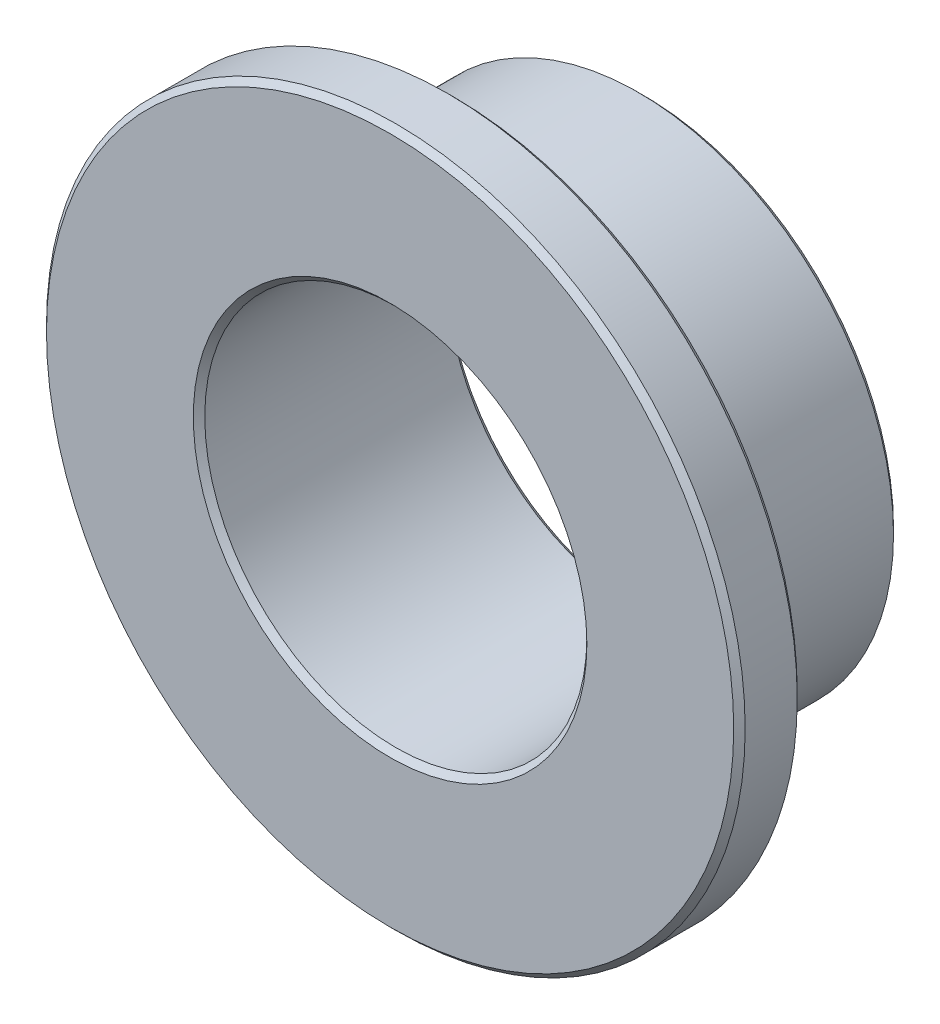
ISO-10303-21;
HEADER;
FILE_DESCRIPTION(('STEP AP214'),'2;1');
FILE_NAME('part.step','',(''),(''),'','','');
FILE_SCHEMA(('AUTOMOTIVE_DESIGN { 1 0 10303 214 1 1 1 1 }'));
ENDSEC;
DATA;
#1=APPLICATION_CONTEXT('core data for automotive mechanical design processes');
#2=APPLICATION_PROTOCOL_DEFINITION('international standard','automotive_design',2000,#1);
#3=PRODUCT_CONTEXT('',#1,'mechanical');
#4=PRODUCT('Part','Part','',(#3));
#5=PRODUCT_RELATED_PRODUCT_CATEGORY('part','',(#4));
#6=PRODUCT_DEFINITION_FORMATION('','',#4);
#7=PRODUCT_DEFINITION_CONTEXT('part definition',#1,'design');
#8=PRODUCT_DEFINITION('design','',#6,#7);
#9=PRODUCT_DEFINITION_SHAPE('','',#8);
#10=(LENGTH_UNIT() NAMED_UNIT(*) SI_UNIT(.MILLI.,.METRE.));
#11=(NAMED_UNIT(*) PLANE_ANGLE_UNIT() SI_UNIT($,.RADIAN.));
#12=(NAMED_UNIT(*) SI_UNIT($,.STERADIAN.) SOLID_ANGLE_UNIT());
#13=UNCERTAINTY_MEASURE_WITH_UNIT(LENGTH_MEASURE(1.E-05),#10,'distance_accuracy_value','');
#14=(GEOMETRIC_REPRESENTATION_CONTEXT(3) GLOBAL_UNCERTAINTY_ASSIGNED_CONTEXT((#13)) GLOBAL_UNIT_ASSIGNED_CONTEXT((#10,
#11,#12)) REPRESENTATION_CONTEXT('',''));
#15=CARTESIAN_POINT('',(0.,0.,0.));
#16=DIRECTION('',(0.,0.,1.));
#17=DIRECTION('',(1.,0.,0.));
#18=AXIS2_PLACEMENT_3D('',#15,#16,#17);
#19=CARTESIAN_POINT('',(0.,0.,1.5875));
#20=DIRECTION('',(0.,0.,1.));
#21=DIRECTION('',(1.,0.,0.));
#22=AXIS2_PLACEMENT_3D('',#19,#20,#21);
#23=CYLINDRICAL_SURFACE('',#22,8.73125);
#24=CARTESIAN_POINT('',(0.,0.,3.031744));
#25=DIRECTION('',(0.,0.,1.));
#26=DIRECTION('',(1.,0.,0.));
#27=AXIS2_PLACEMENT_3D('',#24,#25,#26);
#28=CIRCLE('',#27,8.73125);
#29=CARTESIAN_POINT('',(8.73125,0.,3.031744));
#30=VERTEX_POINT('',#29);
#31=EDGE_CURVE('E71',#30,#30,#28,.F.);
#32=ORIENTED_EDGE('',*,*,#31,.T.);
#33=EDGE_LOOP('',(#32));
#34=FACE_BOUND('',#33,.T.);
#35=CARTESIAN_POINT('',(0.,0.,1.730756));
#36=DIRECTION('',(0.,0.,1.));
#37=DIRECTION('',(1.,0.,0.));
#38=AXIS2_PLACEMENT_3D('',#35,#36,#37);
#39=CIRCLE('',#38,8.73125);
#40=CARTESIAN_POINT('',(8.73125,0.,1.730756));
#41=VERTEX_POINT('',#40);
#42=EDGE_CURVE('E75',#41,#41,#39,.T.);
#43=ORIENTED_EDGE('',*,*,#42,.T.);
#44=EDGE_LOOP('',(#43));
#45=FACE_BOUND('',#44,.T.);
#46=ADVANCED_FACE('F39',(#34,#45),#23,.T.);
#47=CARTESIAN_POINT('',(0.,0.,1.5875));
#48=DIRECTION('',(0.,0.,1.));
#49=DIRECTION('',(1.,0.,0.));
#50=AXIS2_PLACEMENT_3D('',#47,#48,#49);
#51=PLANE('',#50);
#52=CARTESIAN_POINT('',(0.,0.,1.5875));
#53=DIRECTION('',(0.,0.,1.));
#54=DIRECTION('',(1.,0.,0.));
#55=AXIS2_PLACEMENT_3D('',#52,#53,#54);
#56=CIRCLE('',#55,8.587994);
#57=CARTESIAN_POINT('',(8.587994,0.,1.5875));
#58=VERTEX_POINT('',#57);
#59=EDGE_CURVE('E63',#58,#58,#56,.F.);
#60=ORIENTED_EDGE('',*,*,#59,.T.);
#61=EDGE_LOOP('',(#60));
#62=FACE_BOUND('',#61,.T.);
#63=CARTESIAN_POINT('',(0.,0.,1.5875));
#64=DIRECTION('',(0.,0.,1.));
#65=DIRECTION('',(1.,0.,0.));
#66=AXIS2_PLACEMENT_3D('',#63,#64,#65);
#67=CIRCLE('',#66,6.51865599999999);
#68=CARTESIAN_POINT('',(6.51865599999999,0.,1.5875));
#69=VERTEX_POINT('',#68);
#70=EDGE_CURVE('E67',#69,#69,#67,.T.);
#71=ORIENTED_EDGE('',*,*,#70,.T.);
#72=EDGE_LOOP('',(#71));
#73=FACE_BOUND('',#72,.T.);
#74=ADVANCED_FACE('F111',(#62,#73),#51,.F.);
#75=CARTESIAN_POINT('',(0.,0.,3.175));
#76=DIRECTION('',(0.,0.,1.));
#77=DIRECTION('',(1.,0.,0.));
#78=AXIS2_PLACEMENT_3D('',#75,#76,#77);
#79=PLANE('',#78);
#80=CARTESIAN_POINT('',(0.,0.,3.175));
#81=DIRECTION('',(0.,0.,1.));
#82=DIRECTION('',(1.,0.,0.));
#83=AXIS2_PLACEMENT_3D('',#80,#81,#82);
#84=CIRCLE('',#83,4.91845600000001);
#85=CARTESIAN_POINT('',(4.91845600000001,0.,3.175));
#86=VERTEX_POINT('',#85);
#87=EDGE_CURVE('E79',#86,#86,#84,.F.);
#88=ORIENTED_EDGE('',*,*,#87,.T.);
#89=EDGE_LOOP('',(#88));
#90=FACE_BOUND('',#89,.T.);
#91=CARTESIAN_POINT('',(0.,0.,3.175));
#92=DIRECTION('',(0.,0.,1.));
#93=DIRECTION('',(1.,0.,0.));
#94=AXIS2_PLACEMENT_3D('',#91,#92,#93);
#95=CIRCLE('',#94,8.587994);
#96=CARTESIAN_POINT('',(8.587994,0.,3.175));
#97=VERTEX_POINT('',#96);
#98=EDGE_CURVE('E83',#97,#97,#95,.T.);
#99=ORIENTED_EDGE('',*,*,#98,.T.);
#100=EDGE_LOOP('',(#99));
#101=FACE_BOUND('',#100,.T.);
#102=ADVANCED_FACE('F117',(#90,#101),#79,.T.);
#103=CARTESIAN_POINT('',(0.,0.,1.5875));
#104=DIRECTION('',(0.,0.,1.));
#105=DIRECTION('',(1.,0.,0.));
#106=AXIS2_PLACEMENT_3D('',#103,#104,#105);
#107=CYLINDRICAL_SURFACE('',#106,4.7752);
#108=CARTESIAN_POINT('',(0.,0.,3.03174399999999));
#109=DIRECTION('',(0.,0.,1.));
#110=DIRECTION('',(1.,0.,0.));
#111=AXIS2_PLACEMENT_3D('',#108,#109,#110);
#112=CIRCLE('',#111,4.7752);
#113=CARTESIAN_POINT('',(4.7752,0.,3.03174399999999));
#114=VERTEX_POINT('',#113);
#115=EDGE_CURVE('E87',#114,#114,#112,.T.);
#116=ORIENTED_EDGE('',*,*,#115,.T.);
#117=EDGE_LOOP('',(#116));
#118=FACE_BOUND('',#117,.T.);
#119=CARTESIAN_POINT('',(0.,0.,-3.03174399999999));
#120=DIRECTION('',(0.,0.,1.));
#121=DIRECTION('',(1.,0.,0.));
#122=AXIS2_PLACEMENT_3D('',#119,#120,#121);
#123=CIRCLE('',#122,4.7752);
#124=CARTESIAN_POINT('',(4.7752,0.,-3.03174399999999));
#125=VERTEX_POINT('',#124);
#126=EDGE_CURVE('E91',#125,#125,#123,.F.);
#127=ORIENTED_EDGE('',*,*,#126,.T.);
#128=EDGE_LOOP('',(#127));
#129=FACE_BOUND('',#128,.T.);
#130=ADVANCED_FACE('F96',(#118,#129),#107,.F.);
#131=CARTESIAN_POINT('',(0.,0.,-3.175));
#132=DIRECTION('',(0.,0.,1.));
#133=DIRECTION('',(1.,0.,0.));
#134=AXIS2_PLACEMENT_3D('',#131,#132,#133);
#135=CYLINDRICAL_SURFACE('',#134,6.3754);
#136=CARTESIAN_POINT('',(0.,0.,1.44424400000001));
#137=DIRECTION('',(0.,0.,1.));
#138=DIRECTION('',(1.,0.,0.));
#139=AXIS2_PLACEMENT_3D('',#136,#137,#138);
#140=CIRCLE('',#139,6.3754);
#141=CARTESIAN_POINT('',(6.3754,0.,1.44424400000001));
#142=VERTEX_POINT('',#141);
#143=EDGE_CURVE('E52',#142,#142,#140,.F.);
#144=CARTESIAN_POINT('',(0.,0.,-3.03174399999999));
#145=DIRECTION('',(0.,0.,1.));
#146=DIRECTION('',(1.,0.,0.));
#147=AXIS2_PLACEMENT_3D('',#144,#145,#146);
#148=CIRCLE('',#147,6.3754);
#149=CARTESIAN_POINT('',(6.3754,0.,-3.03174399999999));
#150=VERTEX_POINT('',#149);
#151=EDGE_CURVE('E57',#150,#150,#148,.T.);
#152=CARTESIAN_POINT('',(6.3754,0.,1.44424400000001));
#153=CARTESIAN_POINT('',(6.3754,0.,1.39761912500001));
#154=CARTESIAN_POINT('',(6.3754,0.,1.35099425000001));
#155=CARTESIAN_POINT('',(6.3754,0.,1.25774450000001));
#156=CARTESIAN_POINT('',(6.3754,0.,1.21111962500001));
#157=CARTESIAN_POINT('',(6.3754,0.,1.11786987500001));
#158=CARTESIAN_POINT('',(6.3754,0.,1.07124500000001));
#159=CARTESIAN_POINT('',(6.3754,0.,0.977995250000006));
#160=CARTESIAN_POINT('',(6.3754,0.,0.931370375000006));
#161=CARTESIAN_POINT('',(6.3754,0.,0.838120625000006));
#162=CARTESIAN_POINT('',(6.3754,0.,0.791495750000006));
#163=CARTESIAN_POINT('',(6.3754,0.,0.698246000000006));
#164=CARTESIAN_POINT('',(6.3754,0.,0.651621125000006));
#165=CARTESIAN_POINT('',(6.3754,0.,0.558371375000006));
#166=CARTESIAN_POINT('',(6.3754,0.,0.511746500000006));
#167=CARTESIAN_POINT('',(6.3754,0.,0.418496750000006));
#168=CARTESIAN_POINT('',(6.3754,0.,0.371871875000006));
#169=CARTESIAN_POINT('',(6.3754,0.,0.278622125000006));
#170=CARTESIAN_POINT('',(6.3754,0.,0.231997250000007));
#171=CARTESIAN_POINT('',(6.3754,0.,0.138747500000007));
#172=CARTESIAN_POINT('',(6.3754,0.,0.0921226250000068));
#173=CARTESIAN_POINT('',(6.3754,0.,-0.00112712499999321));
#174=CARTESIAN_POINT('',(6.3754,0.,-0.0477519999999932));
#175=CARTESIAN_POINT('',(6.3754,0.,-0.141001749999993));
#176=CARTESIAN_POINT('',(6.3754,0.,-0.187626624999993));
#177=CARTESIAN_POINT('',(6.3754,0.,-0.280876374999993));
#178=CARTESIAN_POINT('',(6.3754,0.,-0.327501249999993));
#179=CARTESIAN_POINT('',(6.3754,0.,-0.420750999999993));
#180=CARTESIAN_POINT('',(6.3754,0.,-0.467375874999993));
#181=CARTESIAN_POINT('',(6.3754,0.,-0.560625624999993));
#182=CARTESIAN_POINT('',(6.3754,0.,-0.607250499999992));
#183=CARTESIAN_POINT('',(6.3754,0.,-0.700500249999992));
#184=CARTESIAN_POINT('',(6.3754,0.,-0.747125124999992));
#185=CARTESIAN_POINT('',(6.3754,0.,-0.840374874999992));
#186=CARTESIAN_POINT('',(6.3754,0.,-0.886999749999992));
#187=CARTESIAN_POINT('',(6.3754,0.,-0.980249499999992));
#188=CARTESIAN_POINT('',(6.3754,0.,-1.02687437499999));
#189=CARTESIAN_POINT('',(6.3754,0.,-1.12012412499999));
#190=CARTESIAN_POINT('',(6.3754,0.,-1.16674899999999));
#191=CARTESIAN_POINT('',(6.3754,0.,-1.25999874999999));
#192=CARTESIAN_POINT('',(6.3754,0.,-1.30662362499999));
#193=CARTESIAN_POINT('',(6.3754,0.,-1.39987337499999));
#194=CARTESIAN_POINT('',(6.3754,0.,-1.44649824999999));
#195=CARTESIAN_POINT('',(6.3754,0.,-1.53974799999999));
#196=CARTESIAN_POINT('',(6.3754,0.,-1.58637287499999));
#197=CARTESIAN_POINT('',(6.3754,0.,-1.67962262499999));
#198=CARTESIAN_POINT('',(6.3754,0.,-1.72624749999999));
#199=CARTESIAN_POINT('',(6.3754,0.,-1.81949724999999));
#200=CARTESIAN_POINT('',(6.3754,0.,-1.86612212499999));
#201=CARTESIAN_POINT('',(6.3754,0.,-1.95937187499999));
#202=CARTESIAN_POINT('',(6.3754,0.,-2.00599674999999));
#203=CARTESIAN_POINT('',(6.3754,0.,-2.09924649999999));
#204=CARTESIAN_POINT('',(6.3754,0.,-2.14587137499999));
#205=CARTESIAN_POINT('',(6.3754,0.,-2.23912112499999));
#206=CARTESIAN_POINT('',(6.3754,0.,-2.28574599999999));
#207=CARTESIAN_POINT('',(6.3754,0.,-2.37899574999999));
#208=CARTESIAN_POINT('',(6.3754,0.,-2.42562062499999));
#209=CARTESIAN_POINT('',(6.3754,0.,-2.51887037499999));
#210=CARTESIAN_POINT('',(6.3754,0.,-2.56549524999999));
#211=CARTESIAN_POINT('',(6.3754,0.,-2.65874499999999));
#212=CARTESIAN_POINT('',(6.3754,0.,-2.70536987499999));
#213=CARTESIAN_POINT('',(6.3754,0.,-2.79861962499999));
#214=CARTESIAN_POINT('',(6.3754,0.,-2.84524449999999));
#215=CARTESIAN_POINT('',(6.3754,0.,-2.93849424999999));
#216=CARTESIAN_POINT('',(6.3754,0.,-2.98511912499999));
#217=CARTESIAN_POINT('',(6.3754,0.,-3.03174399999999));
#218=B_SPLINE_CURVE_WITH_KNOTS('',3,(#152,#153,#154,#155,#156,#157,#158,#159,#160,#161,#162,
#163,#164,#165,#166,#167,#168,#169,#170,#171,#172,#173,#174,#175,#176,#177,#178,#179,#180,#181,
#182,#183,#184,#185,#186,#187,#188,#189,#190,#191,#192,#193,#194,#195,#196,#197,#198,#199,#200,
#201,#202,#203,#204,#205,#206,#207,#208,#209,#210,#211,#212,#213,#214,#215,#216,#217),
.UNSPECIFIED.,.F.,.F.,(4,2,2,2,2,2,2,2,2,2,2,2,2,2,2,2,2,2,2,2,2,2,2,2,2,2,2,2,2,2,2,2,4),(0.,
0.139874625,0.27974925,0.419623875,0.559498499999999,0.699373125,0.839247749999999,
0.979122374999999,1.118997,1.258871625,1.39874625,1.538620875,1.6784955,1.818370125,1.95824475,
2.098119375,2.237994,2.377868625,2.51774325,2.657617875,2.7974925,2.937367125,3.07724175,
3.217116375,3.356991,3.496865625,3.63674025,3.776614875,3.9164895,4.056364125,4.19623874999999,
4.336113375,4.47598799999999),.UNSPECIFIED.);
#219=EDGE_CURVE('BSEAM179',#142,#150,#218,.T.);
#220=ORIENTED_EDGE('',*,*,#143,.T.);
#221=ORIENTED_EDGE('',*,*,#151,.T.);
#222=ORIENTED_EDGE('',*,*,#219,.T.);
#223=ORIENTED_EDGE('',*,*,#219,.F.);
#224=EDGE_LOOP('',(#220,#222,#221,#223));
#225=FACE_BOUND('',#224,.T.);
#226=ADVANCED_FACE('F179',(#225),#135,.T.);
#227=CARTESIAN_POINT('',(0.,0.,-3.175));
#228=DIRECTION('',(0.,0.,1.));
#229=DIRECTION('',(1.,0.,0.));
#230=AXIS2_PLACEMENT_3D('',#227,#228,#229);
#231=PLANE('',#230);
#232=CARTESIAN_POINT('',(0.,0.,-3.175));
#233=DIRECTION('',(0.,0.,1.));
#234=DIRECTION('',(1.,0.,0.));
#235=AXIS2_PLACEMENT_3D('',#232,#233,#234);
#236=CIRCLE('',#235,4.918456);
#237=CARTESIAN_POINT('',(4.918456,0.,-3.175));
#238=VERTEX_POINT('',#237);
#239=EDGE_CURVE('E10',#238,#238,#236,.T.);
#240=ORIENTED_EDGE('',*,*,#239,.T.);
#241=EDGE_LOOP('',(#240));
#242=FACE_BOUND('',#241,.T.);
#243=CARTESIAN_POINT('',(0.,0.,-3.175));
#244=DIRECTION('',(0.,0.,1.));
#245=DIRECTION('',(1.,0.,0.));
#246=AXIS2_PLACEMENT_3D('',#243,#244,#245);
#247=CIRCLE('',#246,6.23214399999999);
#248=CARTESIAN_POINT('',(6.23214399999999,0.,-3.175));
#249=VERTEX_POINT('',#248);
#250=EDGE_CURVE('E47',#249,#249,#247,.F.);
#251=ORIENTED_EDGE('',*,*,#250,.T.);
#252=EDGE_LOOP('',(#251));
#253=FACE_BOUND('',#252,.T.);
#254=ADVANCED_FACE('F127',(#242,#253),#231,.F.);
#255=CARTESIAN_POINT('',(0.,0.,3.03174399999999));
#256=DIRECTION('',(0.,0.,1.));
#257=DIRECTION('',(1.,0.,0.));
#258=AXIS2_PLACEMENT_3D('',#255,#256,#257);
#259=CONICAL_SURFACE('',#258,4.7752,0.785398163397442);
#260=ORIENTED_EDGE('',*,*,#87,.F.);
#261=EDGE_LOOP('',(#260));
#262=FACE_BOUND('',#261,.T.);
#263=ORIENTED_EDGE('',*,*,#115,.F.);
#264=EDGE_LOOP('',(#263));
#265=FACE_BOUND('',#264,.T.);
#266=ADVANCED_FACE('F123',(#262,#265),#259,.F.);
#267=CARTESIAN_POINT('',(0.,0.,3.175));
#268=DIRECTION('',(0.,0.,-1.));
#269=DIRECTION('',(-1.,0.,0.));
#270=AXIS2_PLACEMENT_3D('',#267,#268,#269);
#271=CONICAL_SURFACE('',#270,8.587994,0.785398163397448);
#272=ORIENTED_EDGE('',*,*,#31,.F.);
#273=EDGE_LOOP('',(#272));
#274=FACE_BOUND('',#273,.T.);
#275=ORIENTED_EDGE('',*,*,#98,.F.);
#276=EDGE_LOOP('',(#275));
#277=FACE_BOUND('',#276,.T.);
#278=ADVANCED_FACE('F126',(#274,#277),#271,.T.);
#279=CARTESIAN_POINT('',(0.,0.,1.730756));
#280=DIRECTION('',(0.,0.,1.));
#281=DIRECTION('',(1.,0.,0.));
#282=AXIS2_PLACEMENT_3D('',#279,#280,#281);
#283=CONICAL_SURFACE('',#282,8.73125,0.785398163397448);
#284=CARTESIAN_POINT('',(8.587994,0.,1.5875));
#285=CARTESIAN_POINT('',(8.58948625,0.,1.58899225));
#286=CARTESIAN_POINT('',(8.5909785,0.,1.5904845));
#287=CARTESIAN_POINT('',(8.593963,0.,1.593469));
#288=CARTESIAN_POINT('',(8.59545525,0.,1.59496125));
#289=CARTESIAN_POINT('',(8.59843975,0.,1.59794575));
#290=CARTESIAN_POINT('',(8.599932,0.,1.599438));
#291=CARTESIAN_POINT('',(8.6029165,0.,1.6024225));
#292=CARTESIAN_POINT('',(8.60440875,0.,1.60391475));
#293=CARTESIAN_POINT('',(8.60739325,0.,1.60689925));
#294=CARTESIAN_POINT('',(8.6088855,0.,1.6083915));
#295=CARTESIAN_POINT('',(8.61187,0.,1.611376));
#296=CARTESIAN_POINT('',(8.61336225,0.,1.61286825));
#297=CARTESIAN_POINT('',(8.61634675,0.,1.61585275));
#298=CARTESIAN_POINT('',(8.617839,0.,1.617345));
#299=CARTESIAN_POINT('',(8.6208235,0.,1.6203295));
#300=CARTESIAN_POINT('',(8.62231575,0.,1.62182175));
#301=CARTESIAN_POINT('',(8.62530025,0.,1.62480625));
#302=CARTESIAN_POINT('',(8.6267925,0.,1.6262985));
#303=CARTESIAN_POINT('',(8.629777,0.,1.629283));
#304=CARTESIAN_POINT('',(8.63126925,0.,1.63077525));
#305=CARTESIAN_POINT('',(8.63425375,0.,1.63375975));
#306=CARTESIAN_POINT('',(8.635746,0.,1.635252));
#307=CARTESIAN_POINT('',(8.6387305,0.,1.6382365));
#308=CARTESIAN_POINT('',(8.64022275,0.,1.63972875));
#309=CARTESIAN_POINT('',(8.64320725,0.,1.64271325));
#310=CARTESIAN_POINT('',(8.6446995,0.,1.6442055));
#311=CARTESIAN_POINT('',(8.647684,0.,1.64719));
#312=CARTESIAN_POINT('',(8.64917625,0.,1.64868225));
#313=CARTESIAN_POINT('',(8.65216075,0.,1.65166675));
#314=CARTESIAN_POINT('',(8.653653,0.,1.653159));
#315=CARTESIAN_POINT('',(8.6566375,0.,1.6561435));
#316=CARTESIAN_POINT('',(8.65812975,0.,1.65763575));
#317=CARTESIAN_POINT('',(8.66111425,0.,1.66062025));
#318=CARTESIAN_POINT('',(8.6626065,0.,1.6621125));
#319=CARTESIAN_POINT('',(8.665591,0.,1.665097));
#320=CARTESIAN_POINT('',(8.66708325,0.,1.66658925));
#321=CARTESIAN_POINT('',(8.67006775,0.,1.66957375));
#322=CARTESIAN_POINT('',(8.67156,0.,1.671066));
#323=CARTESIAN_POINT('',(8.6745445,0.,1.6740505));
#324=CARTESIAN_POINT('',(8.67603675,0.,1.67554275));
#325=CARTESIAN_POINT('',(8.67902125,0.,1.67852725));
#326=CARTESIAN_POINT('',(8.6805135,0.,1.6800195));
#327=CARTESIAN_POINT('',(8.683498,0.,1.683004));
#328=CARTESIAN_POINT('',(8.68499025,0.,1.68449625));
#329=CARTESIAN_POINT('',(8.68797475,0.,1.68748075));
#330=CARTESIAN_POINT('',(8.689467,0.,1.688973));
#331=CARTESIAN_POINT('',(8.6924515,0.,1.6919575));
#332=CARTESIAN_POINT('',(8.69394375,0.,1.69344975));
#333=CARTESIAN_POINT('',(8.69692825,0.,1.69643425));
#334=CARTESIAN_POINT('',(8.6984205,0.,1.6979265));
#335=CARTESIAN_POINT('',(8.701405,0.,1.700911));
#336=CARTESIAN_POINT('',(8.70289725,0.,1.70240325));
#337=CARTESIAN_POINT('',(8.70588175,0.,1.70538775));
#338=CARTESIAN_POINT('',(8.707374,0.,1.70688));
#339=CARTESIAN_POINT('',(8.7103585,0.,1.7098645));
#340=CARTESIAN_POINT('',(8.71185075,0.,1.71135675));
#341=CARTESIAN_POINT('',(8.71483525,0.,1.71434125));
#342=CARTESIAN_POINT('',(8.7163275,0.,1.7158335));
#343=CARTESIAN_POINT('',(8.719312,0.,1.718818));
#344=CARTESIAN_POINT('',(8.72080425,0.,1.72031025));
#345=CARTESIAN_POINT('',(8.72378875,0.,1.72329475));
#346=CARTESIAN_POINT('',(8.725281,0.,1.724787));
#347=CARTESIAN_POINT('',(8.7282655,0.,1.7277715));
#348=CARTESIAN_POINT('',(8.72975775,0.,1.72926375));
#349=CARTESIAN_POINT('',(8.73125,0.,1.730756));
#350=B_SPLINE_CURVE_WITH_KNOTS('',3,(#284,#285,#286,#287,#288,#289,#290,#291,#292,#293,#294,
#295,#296,#297,#298,#299,#300,#301,#302,#303,#304,#305,#306,#307,#308,#309,#310,#311,#312,#313,
#314,#315,#316,#317,#318,#319,#320,#321,#322,#323,#324,#325,#326,#327,#328,#329,#330,#331,#332,
#333,#334,#335,#336,#337,#338,#339,#340,#341,#342,#343,#344,#345,#346,#347,#348,#349),
.UNSPECIFIED.,.F.,.F.,(4,2,2,2,2,2,2,2,2,2,2,2,2,2,2,2,2,2,2,2,2,2,2,2,2,2,2,2,2,2,2,2,4),(0.,
0.00633108056535335,0.0126621611307079,0.0189932416960613,0.0253243222614146,0.0316554028267692,
0.0379864833921226,0.0443175639574771,0.0506486445228305,0.0569797250881838,0.0633108056535384,
0.0696418862188918,0.0759729667842451,0.0823040473495997,0.0886351279149531,0.0949662084803076,
0.101297289045661,0.107628369611014,0.113959450176369,0.120290530741722,0.126621611307076,
0.13295269187243,0.139283772437784,0.145614853003138,0.151945933568492,0.158277014133845,
0.164608094699199,0.170939175264553,0.177270255829906,0.183601336395261,0.189932416960614,
0.196263497525969,0.202594578091322),.UNSPECIFIED.);
#351=EDGE_CURVE('BSEAM107',#58,#41,#350,.T.);
#352=ORIENTED_EDGE('',*,*,#59,.F.);
#353=ORIENTED_EDGE('',*,*,#42,.F.);
#354=ORIENTED_EDGE('',*,*,#351,.T.);
#355=ORIENTED_EDGE('',*,*,#351,.F.);
#356=EDGE_LOOP('',(#352,#354,#353,#355));
#357=FACE_BOUND('',#356,.T.);
#358=ADVANCED_FACE('F107',(#357),#283,.T.);
#359=CARTESIAN_POINT('',(0.,0.,1.5875));
#360=DIRECTION('',(0.,0.,1.));
#361=DIRECTION('',(1.,0.,0.));
#362=AXIS2_PLACEMENT_3D('',#359,#360,#361);
#363=CONICAL_SURFACE('',#362,6.51865599999999,0.785398163397451);
#364=ORIENTED_EDGE('',*,*,#143,.F.);
#365=EDGE_LOOP('',(#364));
#366=FACE_BOUND('',#365,.T.);
#367=ORIENTED_EDGE('',*,*,#70,.F.);
#368=EDGE_LOOP('',(#367));
#369=FACE_BOUND('',#368,.T.);
#370=ADVANCED_FACE('F101',(#366,#369),#363,.T.);
#371=CARTESIAN_POINT('',(0.,0.,-3.175));
#372=DIRECTION('',(0.,0.,-1.));
#373=DIRECTION('',(-1.,0.,0.));
#374=AXIS2_PLACEMENT_3D('',#371,#372,#373);
#375=CONICAL_SURFACE('',#374,4.918456,0.785398163397445);
#376=ORIENTED_EDGE('',*,*,#126,.F.);
#377=EDGE_LOOP('',(#376));
#378=FACE_BOUND('',#377,.T.);
#379=ORIENTED_EDGE('',*,*,#239,.F.);
#380=EDGE_LOOP('',(#379));
#381=FACE_BOUND('',#380,.T.);
#382=ADVANCED_FACE('F98',(#378,#381),#375,.F.);
#383=CARTESIAN_POINT('',(0.,0.,-3.03174399999999));
#384=DIRECTION('',(0.,0.,1.));
#385=DIRECTION('',(1.,0.,0.));
#386=AXIS2_PLACEMENT_3D('',#383,#384,#385);
#387=CONICAL_SURFACE('',#386,6.3754,0.785398163397457);
#388=ORIENTED_EDGE('',*,*,#250,.F.);
#389=EDGE_LOOP('',(#388));
#390=FACE_BOUND('',#389,.T.);
#391=ORIENTED_EDGE('',*,*,#151,.F.);
#392=EDGE_LOOP('',(#391));
#393=FACE_BOUND('',#392,.T.);
#394=ADVANCED_FACE('F41',(#390,#393),#387,.T.);
#395=CLOSED_SHELL('',(#46,#74,#102,#130,#226,#254,#266,#278,#358,#370,#382,#394));
#396=MANIFOLD_SOLID_BREP('B2',#395);
#397=ADVANCED_BREP_SHAPE_REPRESENTATION('',(#18,#396),#14);
#398=SHAPE_DEFINITION_REPRESENTATION(#9,#397);
ENDSEC;
END-ISO-10303-21;
